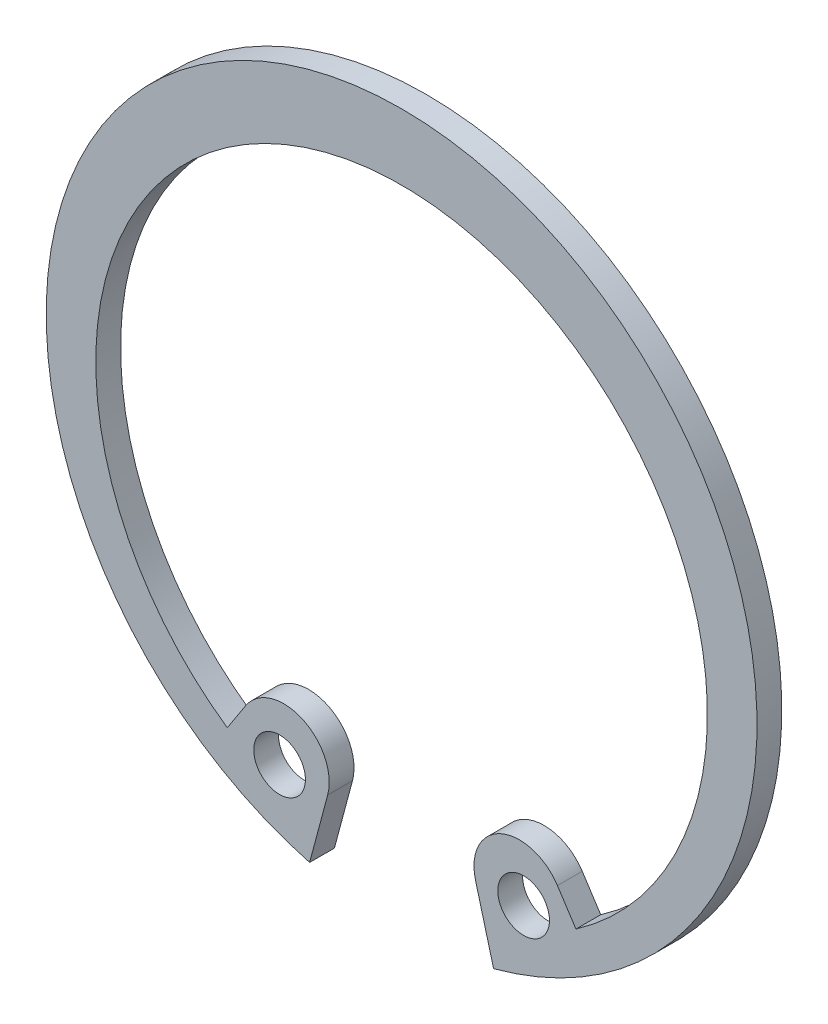
ISO-10303-21;
HEADER;
FILE_DESCRIPTION(('STEP AP214'),'2;1');
FILE_NAME('part.step','',(''),(''),'','','');
FILE_SCHEMA(('AUTOMOTIVE_DESIGN { 1 0 10303 214 1 1 1 1 }'));
ENDSEC;
DATA;
#1=APPLICATION_CONTEXT('core data for automotive mechanical design processes');
#2=APPLICATION_PROTOCOL_DEFINITION('international standard','automotive_design',2000,#1);
#3=PRODUCT_CONTEXT('',#1,'mechanical');
#4=PRODUCT('Part','Part','',(#3));
#5=PRODUCT_RELATED_PRODUCT_CATEGORY('part','',(#4));
#6=PRODUCT_DEFINITION_FORMATION('','',#4);
#7=PRODUCT_DEFINITION_CONTEXT('part definition',#1,'design');
#8=PRODUCT_DEFINITION('design','',#6,#7);
#9=PRODUCT_DEFINITION_SHAPE('','',#8);
#10=(LENGTH_UNIT() NAMED_UNIT(*) SI_UNIT(.MILLI.,.METRE.));
#11=(NAMED_UNIT(*) PLANE_ANGLE_UNIT() SI_UNIT($,.RADIAN.));
#12=(NAMED_UNIT(*) SI_UNIT($,.STERADIAN.) SOLID_ANGLE_UNIT());
#13=UNCERTAINTY_MEASURE_WITH_UNIT(LENGTH_MEASURE(1.E-05),#10,'distance_accuracy_value','');
#14=(GEOMETRIC_REPRESENTATION_CONTEXT(3) GLOBAL_UNCERTAINTY_ASSIGNED_CONTEXT((#13)) GLOBAL_UNIT_ASSIGNED_CONTEXT((#10,
#11,#12)) REPRESENTATION_CONTEXT('',''));
#15=CARTESIAN_POINT('',(0.,0.,0.));
#16=DIRECTION('',(0.,0.,1.));
#17=DIRECTION('',(1.,0.,0.));
#18=AXIS2_PLACEMENT_3D('',#15,#16,#17);
#19=CARTESIAN_POINT('',(5.70021104006176,-12.7839884359083,0.));
#20=DIRECTION('',(0.,0.,-1.));
#21=DIRECTION('',(-1.,0.,0.));
#22=AXIS2_PLACEMENT_3D('',#19,#20,#21);
#23=CYLINDRICAL_SURFACE('',#22,2.19724137931034);
#24=DIRECTION('',(0.,0.,-1.));
#25=VECTOR('',#24,1.);
#26=CARTESIAN_POINT('',(7.54165747450375,-11.5852621502056,1.2));
#27=LINE('',#26,#25);
#28=CARTESIAN_POINT('',(7.54165747450375,-11.5852621502056,0.));
#29=VERTEX_POINT('',#28);
#30=CARTESIAN_POINT('',(7.54165747450375,-11.5852621502056,1.2));
#31=VERTEX_POINT('',#30);
#32=EDGE_CURVE('E209',#29,#31,#27,.F.);
#33=ORIENTED_EDGE('',*,*,#32,.F.);
#34=CARTESIAN_POINT('',(5.70021104006176,-12.7839884359083,0.));
#35=DIRECTION('',(0.,0.,1.));
#36=DIRECTION('',(1.,0.,0.));
#37=AXIS2_PLACEMENT_3D('',#34,#35,#36);
#38=CIRCLE('',#37,2.19724137931034);
#39=CARTESIAN_POINT('',(3.57783884519487,-13.3526763515611,0.));
#40=VERTEX_POINT('',#39);
#41=EDGE_CURVE('E60',#40,#29,#38,.F.);
#42=ORIENTED_EDGE('',*,*,#41,.F.);
#43=DIRECTION('',(0.,0.,-1.));
#44=VECTOR('',#43,1.);
#45=CARTESIAN_POINT('',(3.57783884519487,-13.3526763515611,1.2));
#46=LINE('',#45,#44);
#47=CARTESIAN_POINT('',(3.57783884519487,-13.3526763515611,1.2));
#48=VERTEX_POINT('',#47);
#49=EDGE_CURVE('E213',#48,#40,#46,.T.);
#50=ORIENTED_EDGE('',*,*,#49,.F.);
#51=CARTESIAN_POINT('',(5.70021104006176,-12.7839884359083,1.2));
#52=DIRECTION('',(0.,0.,1.));
#53=DIRECTION('',(1.,0.,0.));
#54=AXIS2_PLACEMENT_3D('',#51,#52,#53);
#55=CIRCLE('',#54,2.19724137931034);
#56=EDGE_CURVE('E13',#31,#48,#55,.T.);
#57=ORIENTED_EDGE('',*,*,#56,.F.);
#58=EDGE_LOOP('',(#33,#42,#50,#57));
#59=FACE_BOUND('',#58,.T.);
#60=ADVANCED_FACE('F52',(#59),#23,.T.);
#61=CARTESIAN_POINT('',(0.,-0.800000000000003,1.2));
#62=DIRECTION('',(0.,0.,1.));
#63=DIRECTION('',(1.,0.,0.));
#64=AXIS2_PLACEMENT_3D('',#61,#62,#63);
#65=PLANE('',#64);
#66=DIRECTION('',(-0.545559671773026,0.838071980521312,0.));
#67=VECTOR('',#66,1.);
#68=CARTESIAN_POINT('',(6.51841751565151,-10.013392411233,1.2));
#69=LINE('',#68,#67);
#70=CARTESIAN_POINT('',(8.43654612593553,-12.9599625601793,1.2));
#71=VERTEX_POINT('',#70);
#72=EDGE_CURVE('E189',#71,#31,#69,.T.);
#73=ORIENTED_EDGE('',*,*,#72,.T.);
#74=ORIENTED_EDGE('',*,*,#56,.T.);
#75=DIRECTION('',(0.258819045102514,-0.965925826289074,0.));
#76=VECTOR('',#75,1.);
#77=CARTESIAN_POINT('',(3.09240342398753,-11.5410066958217,1.2));
#78=LINE('',#77,#76);
#79=CARTESIAN_POINT('',(4.45168757576327,-16.6139242121721,1.2));
#80=VERTEX_POINT('',#79);
#81=EDGE_CURVE('E121',#48,#80,#78,.T.);
#82=ORIENTED_EDGE('',*,*,#81,.T.);
#83=CARTESIAN_POINT('',(0.,0.,1.2));
#84=DIRECTION('',(0.,0.,1.));
#85=DIRECTION('',(1.,0.,0.));
#86=AXIS2_PLACEMENT_3D('',#83,#84,#85);
#87=CIRCLE('',#86,17.2);
#88=CARTESIAN_POINT('',(-4.45168757576325,-16.6139242121721,1.2));
#89=VERTEX_POINT('',#88);
#90=EDGE_CURVE('E112',#80,#89,#87,.T.);
#91=ORIENTED_EDGE('',*,*,#90,.T.);
#92=DIRECTION('',(-0.258819045102514,-0.965925826289074,0.));
#93=VECTOR('',#92,1.);
#94=CARTESIAN_POINT('',(-3.09240342398753,-11.5410066958217,1.2));
#95=LINE('',#94,#93);
#96=CARTESIAN_POINT('',(-3.57783884519487,-13.3526763515611,1.2));
#97=VERTEX_POINT('',#96);
#98=EDGE_CURVE('E118',#97,#89,#95,.T.);
#99=ORIENTED_EDGE('',*,*,#98,.F.);
#100=CARTESIAN_POINT('',(-5.70021104006173,-12.7839884359083,1.2));
#101=DIRECTION('',(0.,0.,-1.));
#102=DIRECTION('',(-1.,0.,0.));
#103=AXIS2_PLACEMENT_3D('',#100,#101,#102);
#104=CIRCLE('',#103,2.19724137931034);
#105=CARTESIAN_POINT('',(-7.54165747450375,-11.5852621502056,1.2));
#106=VERTEX_POINT('',#105);
#107=EDGE_CURVE('E172',#106,#97,#104,.T.);
#108=ORIENTED_EDGE('',*,*,#107,.F.);
#109=DIRECTION('',(0.545559671773025,0.838071980521313,0.));
#110=VECTOR('',#109,1.);
#111=CARTESIAN_POINT('',(-6.51841751565147,-10.013392411233,1.2));
#112=LINE('',#111,#110);
#113=CARTESIAN_POINT('',(-8.43654612593556,-12.9599625601793,1.2));
#114=VERTEX_POINT('',#113);
#115=EDGE_CURVE('E144',#114,#106,#112,.T.);
#116=ORIENTED_EDGE('',*,*,#115,.F.);
#117=CARTESIAN_POINT('',(0.,-0.800000000000003,1.2));
#118=DIRECTION('',(0.,0.,-1.));
#119=DIRECTION('',(1.,0.,0.));
#120=AXIS2_PLACEMENT_3D('',#117,#118,#119);
#121=CIRCLE('',#120,14.8);
#122=EDGE_CURVE('E126',#114,#71,#121,.T.);
#123=ORIENTED_EDGE('',*,*,#122,.T.);
#124=EDGE_LOOP('',(#73,#74,#82,#91,#99,#108,#116,#123));
#125=FACE_BOUND('',#124,.T.);
#126=CARTESIAN_POINT('',(5.90495354342228,-13.2431689428937,1.2));
#127=DIRECTION('',(0.,0.,1.));
#128=DIRECTION('',(1.,0.,0.));
#129=AXIS2_PLACEMENT_3D('',#126,#127,#128);
#130=CIRCLE('',#129,1.25);
#131=CARTESIAN_POINT('',(7.15495354342229,-13.2431689428937,1.2));
#132=VERTEX_POINT('',#131);
#133=EDGE_CURVE('E176',#132,#132,#130,.T.);
#134=ORIENTED_EDGE('',*,*,#133,.F.);
#135=EDGE_LOOP('',(#134));
#136=FACE_BOUND('',#135,.T.);
#137=CARTESIAN_POINT('',(-5.90495354342225,-13.2431689428937,1.2));
#138=DIRECTION('',(0.,0.,-1.));
#139=DIRECTION('',(-1.,0.,0.));
#140=AXIS2_PLACEMENT_3D('',#137,#138,#139);
#141=CIRCLE('',#140,1.25);
#142=CARTESIAN_POINT('',(-7.15495354342226,-13.2431689428937,1.2));
#143=VERTEX_POINT('',#142);
#144=EDGE_CURVE('E158',#143,#143,#141,.T.);
#145=ORIENTED_EDGE('',*,*,#144,.T.);
#146=EDGE_LOOP('',(#145));
#147=FACE_BOUND('',#146,.T.);
#148=ADVANCED_FACE('F114',(#125,#136,#147),#65,.T.);
#149=CARTESIAN_POINT('',(0.,-0.800000000000003,0.));
#150=DIRECTION('',(0.,0.,1.));
#151=DIRECTION('',(1.,0.,0.));
#152=AXIS2_PLACEMENT_3D('',#149,#150,#151);
#153=PLANE('',#152);
#154=DIRECTION('',(0.258819045102514,-0.965925826289074,0.));
#155=VECTOR('',#154,1.);
#156=CARTESIAN_POINT('',(3.09240342398753,-11.5410066958217,0.));
#157=LINE('',#156,#155);
#158=CARTESIAN_POINT('',(4.45168757576327,-16.6139242121721,0.));
#159=VERTEX_POINT('',#158);
#160=EDGE_CURVE('E180',#40,#159,#157,.T.);
#161=ORIENTED_EDGE('',*,*,#160,.F.);
#162=ORIENTED_EDGE('',*,*,#41,.T.);
#163=DIRECTION('',(-0.545559671773026,0.838071980521312,0.));
#164=VECTOR('',#163,1.);
#165=CARTESIAN_POINT('',(6.51841751565151,-10.013392411233,0.));
#166=LINE('',#165,#164);
#167=CARTESIAN_POINT('',(8.43654612593553,-12.9599625601793,0.));
#168=VERTEX_POINT('',#167);
#169=EDGE_CURVE('E185',#168,#29,#166,.T.);
#170=ORIENTED_EDGE('',*,*,#169,.F.);
#171=CARTESIAN_POINT('',(0.,-0.800000000000003,0.));
#172=DIRECTION('',(0.,0.,-1.));
#173=DIRECTION('',(1.,0.,0.));
#174=AXIS2_PLACEMENT_3D('',#171,#172,#173);
#175=CIRCLE('',#174,14.8);
#176=CARTESIAN_POINT('',(-8.43654612593556,-12.9599625601793,0.));
#177=VERTEX_POINT('',#176);
#178=EDGE_CURVE('E197',#177,#168,#175,.T.);
#179=ORIENTED_EDGE('',*,*,#178,.F.);
#180=DIRECTION('',(0.545559671773025,0.838071980521313,0.));
#181=VECTOR('',#180,1.);
#182=CARTESIAN_POINT('',(-6.51841751565147,-10.013392411233,0.));
#183=LINE('',#182,#181);
#184=CARTESIAN_POINT('',(-7.54165747450375,-11.5852621502056,0.));
#185=VERTEX_POINT('',#184);
#186=EDGE_CURVE('E145',#177,#185,#183,.T.);
#187=ORIENTED_EDGE('',*,*,#186,.T.);
#188=CARTESIAN_POINT('',(-5.70021104006173,-12.7839884359083,0.));
#189=DIRECTION('',(0.,0.,-1.));
#190=DIRECTION('',(-1.,0.,0.));
#191=AXIS2_PLACEMENT_3D('',#188,#189,#190);
#192=CIRCLE('',#191,2.19724137931034);
#193=CARTESIAN_POINT('',(-3.57783884519487,-13.3526763515611,0.));
#194=VERTEX_POINT('',#193);
#195=EDGE_CURVE('E168',#194,#185,#192,.F.);
#196=ORIENTED_EDGE('',*,*,#195,.F.);
#197=DIRECTION('',(-0.258819045102514,-0.965925826289074,0.));
#198=VECTOR('',#197,1.);
#199=CARTESIAN_POINT('',(-3.09240342398753,-11.5410066958217,0.));
#200=LINE('',#199,#198);
#201=CARTESIAN_POINT('',(-4.45168757576325,-16.6139242121721,0.));
#202=VERTEX_POINT('',#201);
#203=EDGE_CURVE('E151',#194,#202,#200,.T.);
#204=ORIENTED_EDGE('',*,*,#203,.T.);
#205=CARTESIAN_POINT('',(0.,0.,0.));
#206=DIRECTION('',(0.,0.,1.));
#207=DIRECTION('',(1.,0.,0.));
#208=AXIS2_PLACEMENT_3D('',#205,#206,#207);
#209=CIRCLE('',#208,17.2);
#210=EDGE_CURVE('E132',#159,#202,#209,.T.);
#211=ORIENTED_EDGE('',*,*,#210,.F.);
#212=EDGE_LOOP('',(#161,#162,#170,#179,#187,#196,#204,#211));
#213=FACE_BOUND('',#212,.T.);
#214=CARTESIAN_POINT('',(5.90495354342228,-13.2431689428937,0.));
#215=DIRECTION('',(0.,0.,1.));
#216=DIRECTION('',(1.,0.,0.));
#217=AXIS2_PLACEMENT_3D('',#214,#215,#216);
#218=CIRCLE('',#217,1.25);
#219=CARTESIAN_POINT('',(7.15495354342229,-13.2431689428937,0.));
#220=VERTEX_POINT('',#219);
#221=EDGE_CURVE('E175',#220,#220,#218,.T.);
#222=ORIENTED_EDGE('',*,*,#221,.T.);
#223=EDGE_LOOP('',(#222));
#224=FACE_BOUND('',#223,.T.);
#225=CARTESIAN_POINT('',(-5.90495354342225,-13.2431689428937,0.));
#226=DIRECTION('',(0.,0.,-1.));
#227=DIRECTION('',(-1.,0.,0.));
#228=AXIS2_PLACEMENT_3D('',#225,#226,#227);
#229=CIRCLE('',#228,1.25);
#230=CARTESIAN_POINT('',(-7.15495354342226,-13.2431689428937,0.));
#231=VERTEX_POINT('',#230);
#232=EDGE_CURVE('E154',#231,#231,#229,.T.);
#233=ORIENTED_EDGE('',*,*,#232,.F.);
#234=EDGE_LOOP('',(#233));
#235=FACE_BOUND('',#234,.T.);
#236=ADVANCED_FACE('F220',(#213,#224,#235),#153,.F.);
#237=CARTESIAN_POINT('',(3.09240342398753,-11.5410066958217,1.2));
#238=DIRECTION('',(0.965925826289074,0.258819045102514,0.));
#239=DIRECTION('',(-0.258819045102514,0.965925826289074,0.));
#240=AXIS2_PLACEMENT_3D('',#237,#238,#239);
#241=PLANE('',#240);
#242=ORIENTED_EDGE('',*,*,#81,.F.);
#243=ORIENTED_EDGE('',*,*,#49,.T.);
#244=ORIENTED_EDGE('',*,*,#160,.T.);
#245=DIRECTION('',(0.,0.,-1.));
#246=VECTOR('',#245,1.);
#247=CARTESIAN_POINT('',(4.45168757576327,-16.6139242121721,1.2));
#248=LINE('',#247,#246);
#249=EDGE_CURVE('E206',#80,#159,#248,.T.);
#250=ORIENTED_EDGE('',*,*,#249,.F.);
#251=EDGE_LOOP('',(#242,#243,#244,#250));
#252=FACE_BOUND('',#251,.T.);
#253=ADVANCED_FACE('F255',(#252),#241,.F.);
#254=CARTESIAN_POINT('',(0.,0.,1.2));
#255=DIRECTION('',(0.,0.,-1.));
#256=DIRECTION('',(-1.,0.,0.));
#257=AXIS2_PLACEMENT_3D('',#254,#255,#256);
#258=CYLINDRICAL_SURFACE('',#257,17.2);
#259=ORIENTED_EDGE('',*,*,#210,.T.);
#260=DIRECTION('',(0.,0.,-1.));
#261=VECTOR('',#260,1.);
#262=CARTESIAN_POINT('',(-4.45168757576325,-16.6139242121721,1.2));
#263=LINE('',#262,#261);
#264=EDGE_CURVE('E129',#89,#202,#263,.T.);
#265=ORIENTED_EDGE('',*,*,#264,.F.);
#266=ORIENTED_EDGE('',*,*,#90,.F.);
#267=ORIENTED_EDGE('',*,*,#249,.T.);
#268=EDGE_LOOP('',(#259,#265,#266,#267));
#269=FACE_BOUND('',#268,.T.);
#270=ADVANCED_FACE('F130',(#269),#258,.T.);
#271=CARTESIAN_POINT('',(0.,-0.800000000000003,1.2));
#272=DIRECTION('',(0.,0.,-1.));
#273=DIRECTION('',(-1.,0.,0.));
#274=AXIS2_PLACEMENT_3D('',#271,#272,#273);
#275=CYLINDRICAL_SURFACE('',#274,14.8);
#276=ORIENTED_EDGE('',*,*,#178,.T.);
#277=DIRECTION('',(0.,0.,-1.));
#278=VECTOR('',#277,1.);
#279=CARTESIAN_POINT('',(8.43654612593553,-12.9599625601793,1.2));
#280=LINE('',#279,#278);
#281=EDGE_CURVE('E192',#71,#168,#280,.T.);
#282=ORIENTED_EDGE('',*,*,#281,.F.);
#283=ORIENTED_EDGE('',*,*,#122,.F.);
#284=DIRECTION('',(0.,0.,-1.));
#285=VECTOR('',#284,1.);
#286=CARTESIAN_POINT('',(-8.43654612593556,-12.9599625601793,1.2));
#287=LINE('',#286,#285);
#288=EDGE_CURVE('E137',#114,#177,#287,.T.);
#289=ORIENTED_EDGE('',*,*,#288,.T.);
#290=EDGE_LOOP('',(#276,#282,#283,#289));
#291=FACE_BOUND('',#290,.T.);
#292=ADVANCED_FACE('F227',(#291),#275,.F.);
#293=CARTESIAN_POINT('',(6.51841751565151,-10.013392411233,1.2));
#294=DIRECTION('',(-0.838071980521312,-0.545559671773026,0.));
#295=DIRECTION('',(0.545559671773026,-0.838071980521312,0.));
#296=AXIS2_PLACEMENT_3D('',#293,#294,#295);
#297=PLANE('',#296);
#298=ORIENTED_EDGE('',*,*,#169,.T.);
#299=ORIENTED_EDGE('',*,*,#32,.T.);
#300=ORIENTED_EDGE('',*,*,#72,.F.);
#301=ORIENTED_EDGE('',*,*,#281,.T.);
#302=EDGE_LOOP('',(#298,#299,#300,#301));
#303=FACE_BOUND('',#302,.T.);
#304=ADVANCED_FACE('F224',(#303),#297,.F.);
#305=CARTESIAN_POINT('',(5.90495354342228,-13.2431689428937,1.2));
#306=DIRECTION('',(0.,0.,-1.));
#307=DIRECTION('',(-1.,0.,0.));
#308=AXIS2_PLACEMENT_3D('',#305,#306,#307);
#309=CYLINDRICAL_SURFACE('',#308,1.25);
#310=ORIENTED_EDGE('',*,*,#133,.T.);
#311=EDGE_LOOP('',(#310));
#312=FACE_BOUND('',#311,.T.);
#313=ORIENTED_EDGE('',*,*,#221,.F.);
#314=EDGE_LOOP('',(#313));
#315=FACE_BOUND('',#314,.T.);
#316=ADVANCED_FACE('F258',(#312,#315),#309,.F.);
#317=CARTESIAN_POINT('',(-5.70021104006173,-12.7839884359083,0.));
#318=DIRECTION('',(0.,0.,-1.));
#319=DIRECTION('',(1.,0.,0.));
#320=AXIS2_PLACEMENT_3D('',#317,#318,#319);
#321=CYLINDRICAL_SURFACE('',#320,2.19724137931034);
#322=DIRECTION('',(0.,0.,-1.));
#323=VECTOR('',#322,1.);
#324=CARTESIAN_POINT('',(-7.54165747450375,-11.5852621502056,1.2));
#325=LINE('',#324,#323);
#326=EDGE_CURVE('E136',#185,#106,#325,.F.);
#327=ORIENTED_EDGE('',*,*,#326,.T.);
#328=ORIENTED_EDGE('',*,*,#107,.T.);
#329=DIRECTION('',(0.,0.,-1.));
#330=VECTOR('',#329,1.);
#331=CARTESIAN_POINT('',(-3.57783884519487,-13.3526763515611,1.2));
#332=LINE('',#331,#330);
#333=EDGE_CURVE('E141',#97,#194,#332,.T.);
#334=ORIENTED_EDGE('',*,*,#333,.T.);
#335=ORIENTED_EDGE('',*,*,#195,.T.);
#336=EDGE_LOOP('',(#327,#328,#334,#335));
#337=FACE_BOUND('',#336,.T.);
#338=ADVANCED_FACE('F234',(#337),#321,.T.);
#339=CARTESIAN_POINT('',(-3.09240342398753,-11.5410066958217,1.2));
#340=DIRECTION('',(-0.965925826289074,0.258819045102514,0.));
#341=DIRECTION('',(0.258819045102514,0.965925826289074,0.));
#342=AXIS2_PLACEMENT_3D('',#339,#340,#341);
#343=PLANE('',#342);
#344=ORIENTED_EDGE('',*,*,#98,.T.);
#345=ORIENTED_EDGE('',*,*,#264,.T.);
#346=ORIENTED_EDGE('',*,*,#203,.F.);
#347=ORIENTED_EDGE('',*,*,#333,.F.);
#348=EDGE_LOOP('',(#344,#345,#346,#347));
#349=FACE_BOUND('',#348,.T.);
#350=ADVANCED_FACE('F139',(#349),#343,.F.);
#351=CARTESIAN_POINT('',(-6.51841751565147,-10.013392411233,1.2));
#352=DIRECTION('',(0.838071980521313,-0.545559671773025,0.));
#353=DIRECTION('',(-0.545559671773025,-0.838071980521313,0.));
#354=AXIS2_PLACEMENT_3D('',#351,#352,#353);
#355=PLANE('',#354);
#356=ORIENTED_EDGE('',*,*,#186,.F.);
#357=ORIENTED_EDGE('',*,*,#288,.F.);
#358=ORIENTED_EDGE('',*,*,#115,.T.);
#359=ORIENTED_EDGE('',*,*,#326,.F.);
#360=EDGE_LOOP('',(#356,#357,#358,#359));
#361=FACE_BOUND('',#360,.T.);
#362=ADVANCED_FACE('F235',(#361),#355,.F.);
#363=CARTESIAN_POINT('',(-5.90495354342225,-13.2431689428937,1.2));
#364=DIRECTION('',(0.,0.,-1.));
#365=DIRECTION('',(1.,0.,0.));
#366=AXIS2_PLACEMENT_3D('',#363,#364,#365);
#367=CYLINDRICAL_SURFACE('',#366,1.25);
#368=ORIENTED_EDGE('',*,*,#144,.F.);
#369=EDGE_LOOP('',(#368));
#370=FACE_BOUND('',#369,.T.);
#371=ORIENTED_EDGE('',*,*,#232,.T.);
#372=EDGE_LOOP('',(#371));
#373=FACE_BOUND('',#372,.T.);
#374=ADVANCED_FACE('F238',(#370,#373),#367,.F.);
#375=CLOSED_SHELL('',(#60,#148,#236,#253,#270,#292,#304,#316,#338,#350,#362,#374));
#376=MANIFOLD_SOLID_BREP('B2',#375);
#377=ADVANCED_BREP_SHAPE_REPRESENTATION('',(#18,#376),#14);
#378=SHAPE_DEFINITION_REPRESENTATION(#9,#377);
ENDSEC;
END-ISO-10303-21;
